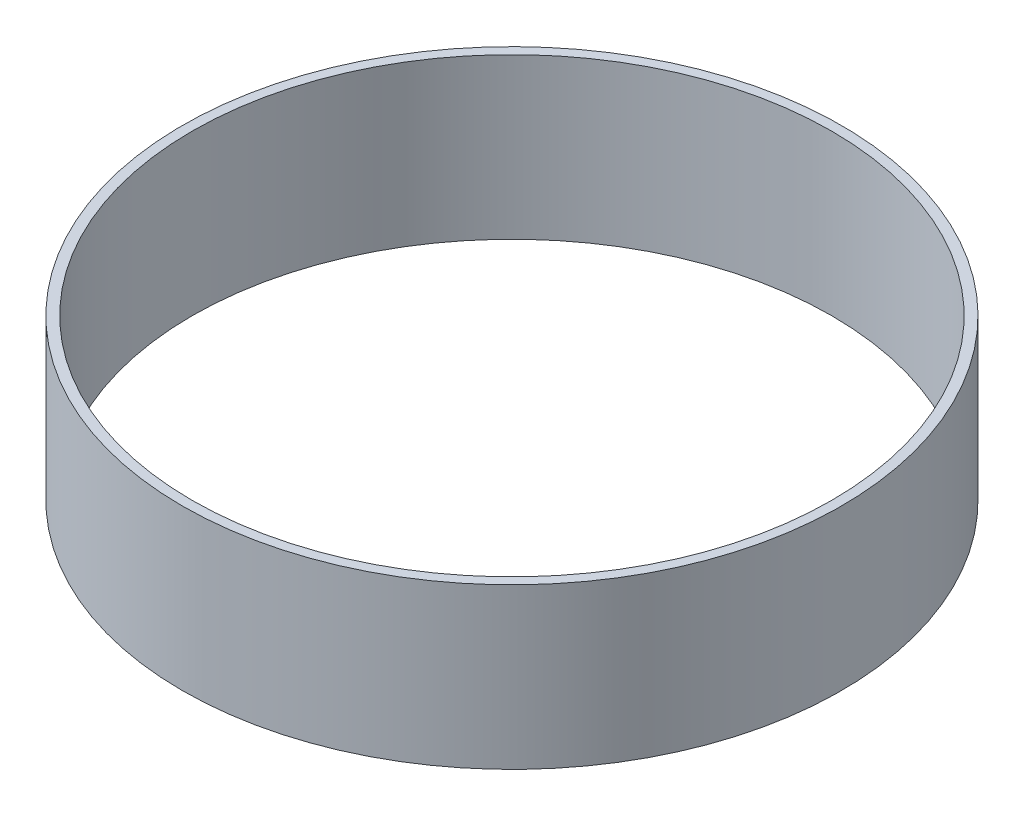
ISO-10303-21;
HEADER;
FILE_DESCRIPTION(('STEP AP214'),'2;1');
FILE_NAME('part.step','',(''),(''),'','','');
FILE_SCHEMA(('AUTOMOTIVE_DESIGN { 1 0 10303 214 1 1 1 1 }'));
ENDSEC;
DATA;
#1=APPLICATION_CONTEXT('core data for automotive mechanical design processes');
#2=APPLICATION_PROTOCOL_DEFINITION('international standard','automotive_design',2000,#1);
#3=PRODUCT_CONTEXT('',#1,'mechanical');
#4=PRODUCT('Part','Part','',(#3));
#5=PRODUCT_RELATED_PRODUCT_CATEGORY('part','',(#4));
#6=PRODUCT_DEFINITION_FORMATION('','',#4);
#7=PRODUCT_DEFINITION_CONTEXT('part definition',#1,'design');
#8=PRODUCT_DEFINITION('design','',#6,#7);
#9=PRODUCT_DEFINITION_SHAPE('','',#8);
#10=(LENGTH_UNIT() NAMED_UNIT(*) SI_UNIT(.MILLI.,.METRE.));
#11=(NAMED_UNIT(*) PLANE_ANGLE_UNIT() SI_UNIT($,.RADIAN.));
#12=(NAMED_UNIT(*) SI_UNIT($,.STERADIAN.) SOLID_ANGLE_UNIT());
#13=UNCERTAINTY_MEASURE_WITH_UNIT(LENGTH_MEASURE(1.E-05),#10,'distance_accuracy_value','');
#14=(GEOMETRIC_REPRESENTATION_CONTEXT(3) GLOBAL_UNCERTAINTY_ASSIGNED_CONTEXT((#13)) GLOBAL_UNIT_ASSIGNED_CONTEXT((#10,
#11,#12)) REPRESENTATION_CONTEXT('',''));
#15=CARTESIAN_POINT('',(0.,0.,0.));
#16=DIRECTION('',(0.,0.,1.));
#17=DIRECTION('',(1.,0.,0.));
#18=AXIS2_PLACEMENT_3D('',#15,#16,#17);
#19=CARTESIAN_POINT('',(0.,31.75,0.));
#20=DIRECTION('',(0.,1.,0.));
#21=DIRECTION('',(0.,0.,1.));
#22=AXIS2_PLACEMENT_3D('',#19,#20,#21);
#23=PLANE('',#22);
#24=CARTESIAN_POINT('',(0.,31.75,0.));
#25=DIRECTION('',(0.,1.,0.));
#26=DIRECTION('',(0.,0.,1.));
#27=AXIS2_PLACEMENT_3D('',#24,#25,#26);
#28=CIRCLE('',#27,65.4431);
#29=CARTESIAN_POINT('',(0.,31.75,65.4431));
#30=VERTEX_POINT('',#29);
#31=EDGE_CURVE('E10',#30,#30,#28,.T.);
#32=ORIENTED_EDGE('',*,*,#31,.T.);
#33=EDGE_LOOP('',(#32));
#34=FACE_BOUND('',#33,.T.);
#35=CARTESIAN_POINT('',(0.,31.75,0.));
#36=DIRECTION('',(0.,1.,0.));
#37=DIRECTION('',(0.,0.,1.));
#38=AXIS2_PLACEMENT_3D('',#35,#36,#37);
#39=CIRCLE('',#38,63.5);
#40=CARTESIAN_POINT('',(0.,31.75,63.5));
#41=VERTEX_POINT('',#40);
#42=EDGE_CURVE('E41',#41,#41,#39,.T.);
#43=ORIENTED_EDGE('',*,*,#42,.F.);
#44=EDGE_LOOP('',(#43));
#45=FACE_BOUND('',#44,.T.);
#46=ADVANCED_FACE('F30',(#34,#45),#23,.T.);
#47=CARTESIAN_POINT('',(0.,0.,0.));
#48=DIRECTION('',(0.,1.,0.));
#49=DIRECTION('',(0.,0.,1.));
#50=AXIS2_PLACEMENT_3D('',#47,#48,#49);
#51=PLANE('',#50);
#52=CARTESIAN_POINT('',(0.,0.,0.));
#53=DIRECTION('',(0.,1.,0.));
#54=DIRECTION('',(0.,0.,1.));
#55=AXIS2_PLACEMENT_3D('',#52,#53,#54);
#56=CIRCLE('',#55,65.4431);
#57=CARTESIAN_POINT('',(0.,0.,65.4431));
#58=VERTEX_POINT('',#57);
#59=EDGE_CURVE('E34',#58,#58,#56,.T.);
#60=ORIENTED_EDGE('',*,*,#59,.F.);
#61=EDGE_LOOP('',(#60));
#62=FACE_BOUND('',#61,.T.);
#63=CARTESIAN_POINT('',(0.,0.,0.));
#64=DIRECTION('',(0.,1.,0.));
#65=DIRECTION('',(0.,0.,1.));
#66=AXIS2_PLACEMENT_3D('',#63,#64,#65);
#67=CIRCLE('',#66,63.5);
#68=CARTESIAN_POINT('',(0.,0.,63.5));
#69=VERTEX_POINT('',#68);
#70=EDGE_CURVE('E43',#69,#69,#67,.T.);
#71=ORIENTED_EDGE('',*,*,#70,.T.);
#72=EDGE_LOOP('',(#71));
#73=FACE_BOUND('',#72,.T.);
#74=ADVANCED_FACE('F53',(#62,#73),#51,.F.);
#75=CARTESIAN_POINT('',(0.,31.75,0.));
#76=DIRECTION('',(0.,-1.,0.));
#77=DIRECTION('',(0.,0.,-1.));
#78=AXIS2_PLACEMENT_3D('',#75,#76,#77);
#79=CYLINDRICAL_SURFACE('',#78,65.4431);
#80=ORIENTED_EDGE('',*,*,#31,.F.);
#81=EDGE_LOOP('',(#80));
#82=FACE_BOUND('',#81,.T.);
#83=ORIENTED_EDGE('',*,*,#59,.T.);
#84=EDGE_LOOP('',(#83));
#85=FACE_BOUND('',#84,.T.);
#86=ADVANCED_FACE('F32',(#82,#85),#79,.T.);
#87=CARTESIAN_POINT('',(0.,31.75,0.));
#88=DIRECTION('',(0.,-1.,0.));
#89=DIRECTION('',(0.,0.,-1.));
#90=AXIS2_PLACEMENT_3D('',#87,#88,#89);
#91=CYLINDRICAL_SURFACE('',#90,63.5);
#92=ORIENTED_EDGE('',*,*,#42,.T.);
#93=EDGE_LOOP('',(#92));
#94=FACE_BOUND('',#93,.T.);
#95=ORIENTED_EDGE('',*,*,#70,.F.);
#96=EDGE_LOOP('',(#95));
#97=FACE_BOUND('',#96,.T.);
#98=ADVANCED_FACE('F49',(#94,#97),#91,.F.);
#99=CLOSED_SHELL('',(#46,#74,#86,#98));
#100=MANIFOLD_SOLID_BREP('B2',#99);
#101=ADVANCED_BREP_SHAPE_REPRESENTATION('',(#18,#100),#14);
#102=SHAPE_DEFINITION_REPRESENTATION(#9,#101);
ENDSEC;
END-ISO-10303-21;
